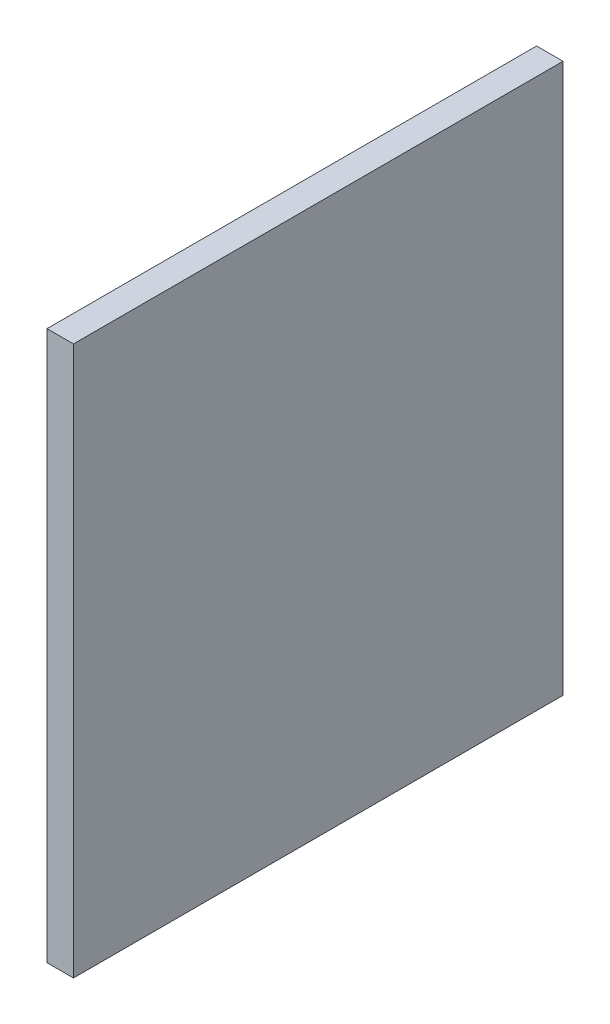
ISO-10303-21;
HEADER;
FILE_DESCRIPTION(('STEP AP214'),'2;1');
FILE_NAME('part.step','',(''),(''),'','','');
FILE_SCHEMA(('AUTOMOTIVE_DESIGN { 1 0 10303 214 1 1 1 1 }'));
ENDSEC;
DATA;
#1=APPLICATION_CONTEXT('core data for automotive mechanical design processes');
#2=APPLICATION_PROTOCOL_DEFINITION('international standard','automotive_design',2000,#1);
#3=PRODUCT_CONTEXT('',#1,'mechanical');
#4=PRODUCT('Part','Part','',(#3));
#5=PRODUCT_RELATED_PRODUCT_CATEGORY('part','',(#4));
#6=PRODUCT_DEFINITION_FORMATION('','',#4);
#7=PRODUCT_DEFINITION_CONTEXT('part definition',#1,'design');
#8=PRODUCT_DEFINITION('design','',#6,#7);
#9=PRODUCT_DEFINITION_SHAPE('','',#8);
#10=(LENGTH_UNIT() NAMED_UNIT(*) SI_UNIT(.MILLI.,.METRE.));
#11=(NAMED_UNIT(*) PLANE_ANGLE_UNIT() SI_UNIT($,.RADIAN.));
#12=(NAMED_UNIT(*) SI_UNIT($,.STERADIAN.) SOLID_ANGLE_UNIT());
#13=UNCERTAINTY_MEASURE_WITH_UNIT(LENGTH_MEASURE(1.E-05),#10,'distance_accuracy_value','');
#14=(GEOMETRIC_REPRESENTATION_CONTEXT(3) GLOBAL_UNCERTAINTY_ASSIGNED_CONTEXT((#13)) GLOBAL_UNIT_ASSIGNED_CONTEXT((#10,
#11,#12)) REPRESENTATION_CONTEXT('',''));
#15=CARTESIAN_POINT('',(0.,0.,0.));
#16=DIRECTION('',(0.,0.,1.));
#17=DIRECTION('',(1.,0.,0.));
#18=AXIS2_PLACEMENT_3D('',#15,#16,#17);
#19=CARTESIAN_POINT('',(16.,-166.,148.));
#20=DIRECTION('',(0.,0.,-1.));
#21=DIRECTION('',(-1.,0.,0.));
#22=AXIS2_PLACEMENT_3D('',#19,#20,#21);
#23=PLANE('',#22);
#24=DIRECTION('',(0.,-1.,0.));
#25=VECTOR('',#24,1.);
#26=CARTESIAN_POINT('',(0.,-166.,148.));
#27=LINE('',#26,#25);
#28=CARTESIAN_POINT('',(0.,166.,148.));
#29=VERTEX_POINT('',#28);
#30=CARTESIAN_POINT('',(0.,-166.,148.));
#31=VERTEX_POINT('',#30);
#32=EDGE_CURVE('E111',#29,#31,#27,.T.);
#33=ORIENTED_EDGE('',*,*,#32,.T.);
#34=DIRECTION('',(-1.,0.,0.));
#35=VECTOR('',#34,1.);
#36=CARTESIAN_POINT('',(16.,-166.,148.));
#37=LINE('',#36,#35);
#38=CARTESIAN_POINT('',(16.,-166.,148.));
#39=VERTEX_POINT('',#38);
#40=EDGE_CURVE('E11',#39,#31,#37,.T.);
#41=ORIENTED_EDGE('',*,*,#40,.F.);
#42=DIRECTION('',(0.,-1.,0.));
#43=VECTOR('',#42,1.);
#44=CARTESIAN_POINT('',(16.,-166.,148.));
#45=LINE('',#44,#43);
#46=CARTESIAN_POINT('',(16.,166.,148.));
#47=VERTEX_POINT('',#46);
#48=EDGE_CURVE('E95',#47,#39,#45,.T.);
#49=ORIENTED_EDGE('',*,*,#48,.F.);
#50=DIRECTION('',(-1.,0.,0.));
#51=VECTOR('',#50,1.);
#52=CARTESIAN_POINT('',(16.,166.,148.));
#53=LINE('',#52,#51);
#54=EDGE_CURVE('E107',#47,#29,#53,.T.);
#55=ORIENTED_EDGE('',*,*,#54,.T.);
#56=EDGE_LOOP('',(#33,#41,#49,#55));
#57=FACE_BOUND('',#56,.T.);
#58=ADVANCED_FACE('F43',(#57),#23,.F.);
#59=CARTESIAN_POINT('',(16.,-166.,-148.));
#60=DIRECTION('',(0.,1.,0.));
#61=DIRECTION('',(0.,0.,1.));
#62=AXIS2_PLACEMENT_3D('',#59,#60,#61);
#63=PLANE('',#62);
#64=DIRECTION('',(0.,0.,-1.));
#65=VECTOR('',#64,1.);
#66=CARTESIAN_POINT('',(0.,-166.,-148.));
#67=LINE('',#66,#65);
#68=CARTESIAN_POINT('',(0.,-166.,-148.));
#69=VERTEX_POINT('',#68);
#70=EDGE_CURVE('E100',#31,#69,#67,.T.);
#71=ORIENTED_EDGE('',*,*,#70,.T.);
#72=DIRECTION('',(-1.,0.,0.));
#73=VECTOR('',#72,1.);
#74=CARTESIAN_POINT('',(16.,-166.,-148.));
#75=LINE('',#74,#73);
#76=CARTESIAN_POINT('',(16.,-166.,-148.));
#77=VERTEX_POINT('',#76);
#78=EDGE_CURVE('E52',#77,#69,#75,.T.);
#79=ORIENTED_EDGE('',*,*,#78,.F.);
#80=DIRECTION('',(0.,0.,-1.));
#81=VECTOR('',#80,1.);
#82=CARTESIAN_POINT('',(16.,-166.,-148.));
#83=LINE('',#82,#81);
#84=EDGE_CURVE('E90',#39,#77,#83,.T.);
#85=ORIENTED_EDGE('',*,*,#84,.F.);
#86=ORIENTED_EDGE('',*,*,#40,.T.);
#87=EDGE_LOOP('',(#71,#79,#85,#86));
#88=FACE_BOUND('',#87,.T.);
#89=ADVANCED_FACE('F99',(#88),#63,.F.);
#90=CARTESIAN_POINT('',(16.,-166.,-148.));
#91=DIRECTION('',(0.,0.,1.));
#92=DIRECTION('',(1.,0.,0.));
#93=AXIS2_PLACEMENT_3D('',#90,#91,#92);
#94=PLANE('',#93);
#95=DIRECTION('',(0.,1.,0.));
#96=VECTOR('',#95,1.);
#97=CARTESIAN_POINT('',(0.,-166.,-148.));
#98=LINE('',#97,#96);
#99=CARTESIAN_POINT('',(0.,166.,-148.));
#100=VERTEX_POINT('',#99);
#101=EDGE_CURVE('E77',#69,#100,#98,.T.);
#102=ORIENTED_EDGE('',*,*,#101,.T.);
#103=DIRECTION('',(-1.,0.,0.));
#104=VECTOR('',#103,1.);
#105=CARTESIAN_POINT('',(16.,166.,-148.));
#106=LINE('',#105,#104);
#107=CARTESIAN_POINT('',(16.,166.,-148.));
#108=VERTEX_POINT('',#107);
#109=EDGE_CURVE('E102',#108,#100,#106,.T.);
#110=ORIENTED_EDGE('',*,*,#109,.F.);
#111=DIRECTION('',(0.,1.,0.));
#112=VECTOR('',#111,1.);
#113=CARTESIAN_POINT('',(16.,-166.,-148.));
#114=LINE('',#113,#112);
#115=EDGE_CURVE('E93',#77,#108,#114,.T.);
#116=ORIENTED_EDGE('',*,*,#115,.F.);
#117=ORIENTED_EDGE('',*,*,#78,.T.);
#118=EDGE_LOOP('',(#102,#110,#116,#117));
#119=FACE_BOUND('',#118,.T.);
#120=ADVANCED_FACE('F103',(#119),#94,.F.);
#121=CARTESIAN_POINT('',(16.,166.,-148.));
#122=DIRECTION('',(0.,-1.,0.));
#123=DIRECTION('',(0.,0.,-1.));
#124=AXIS2_PLACEMENT_3D('',#121,#122,#123);
#125=PLANE('',#124);
#126=DIRECTION('',(0.,0.,1.));
#127=VECTOR('',#126,1.);
#128=CARTESIAN_POINT('',(0.,166.,-148.));
#129=LINE('',#128,#127);
#130=EDGE_CURVE('E83',#100,#29,#129,.T.);
#131=ORIENTED_EDGE('',*,*,#130,.T.);
#132=ORIENTED_EDGE('',*,*,#54,.F.);
#133=DIRECTION('',(0.,0.,1.));
#134=VECTOR('',#133,1.);
#135=CARTESIAN_POINT('',(16.,166.,-148.));
#136=LINE('',#135,#134);
#137=EDGE_CURVE('E60',#108,#47,#136,.T.);
#138=ORIENTED_EDGE('',*,*,#137,.F.);
#139=ORIENTED_EDGE('',*,*,#109,.T.);
#140=EDGE_LOOP('',(#131,#132,#138,#139));
#141=FACE_BOUND('',#140,.T.);
#142=ADVANCED_FACE('F124',(#141),#125,.F.);
#143=CARTESIAN_POINT('',(16.,0.,0.));
#144=DIRECTION('',(1.,0.,0.));
#145=DIRECTION('',(0.,0.,-1.));
#146=AXIS2_PLACEMENT_3D('',#143,#144,#145);
#147=PLANE('',#146);
#148=ORIENTED_EDGE('',*,*,#48,.T.);
#149=ORIENTED_EDGE('',*,*,#84,.T.);
#150=ORIENTED_EDGE('',*,*,#115,.T.);
#151=ORIENTED_EDGE('',*,*,#137,.T.);
#152=EDGE_LOOP('',(#148,#149,#150,#151));
#153=FACE_BOUND('',#152,.T.);
#154=ADVANCED_FACE('F91',(#153),#147,.T.);
#155=CARTESIAN_POINT('',(0.,0.,0.));
#156=DIRECTION('',(1.,0.,0.));
#157=DIRECTION('',(0.,0.,-1.));
#158=AXIS2_PLACEMENT_3D('',#155,#156,#157);
#159=PLANE('',#158);
#160=ORIENTED_EDGE('',*,*,#32,.F.);
#161=ORIENTED_EDGE('',*,*,#130,.F.);
#162=ORIENTED_EDGE('',*,*,#101,.F.);
#163=ORIENTED_EDGE('',*,*,#70,.F.);
#164=EDGE_LOOP('',(#160,#161,#162,#163));
#165=FACE_BOUND('',#164,.T.);
#166=ADVANCED_FACE('F127',(#165),#159,.F.);
#167=CLOSED_SHELL('',(#58,#89,#120,#142,#154,#166));
#168=MANIFOLD_SOLID_BREP('B2',#167);
#169=ADVANCED_BREP_SHAPE_REPRESENTATION('',(#18,#168),#14);
#170=SHAPE_DEFINITION_REPRESENTATION(#9,#169);
ENDSEC;
END-ISO-10303-21;
